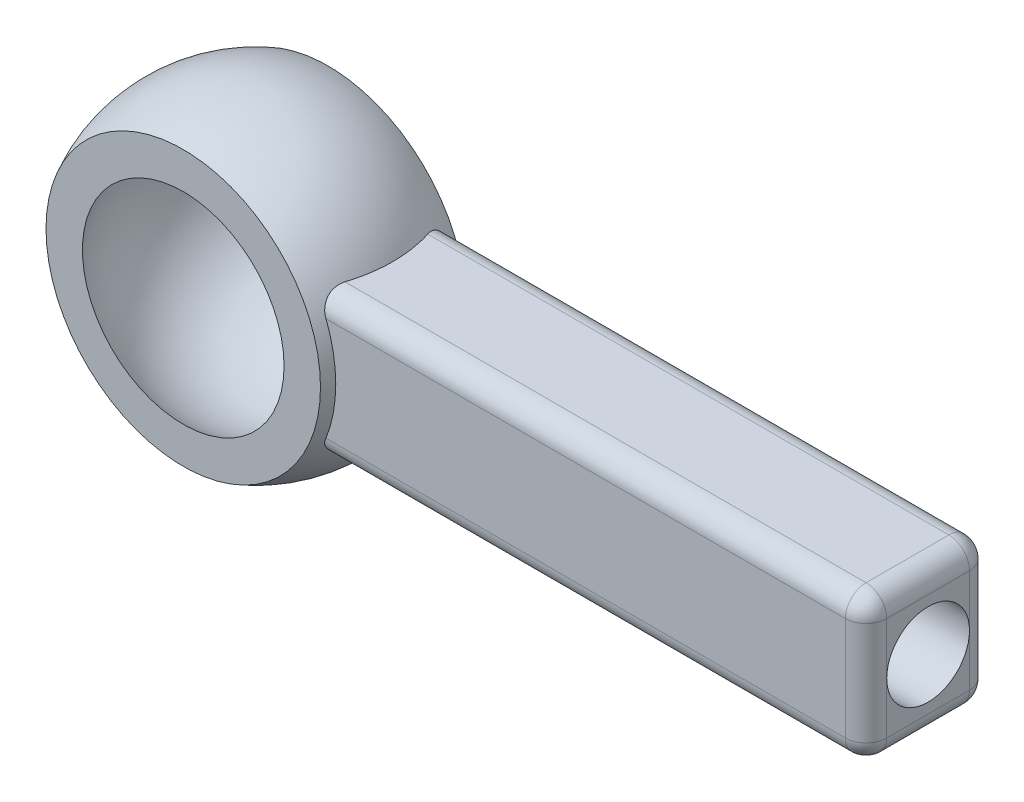
ISO-10303-21;
HEADER;
FILE_DESCRIPTION(('STEP AP214'),'2;1');
FILE_NAME('part.step','',(''),(''),'','','');
FILE_SCHEMA(('AUTOMOTIVE_DESIGN { 1 0 10303 214 1 1 1 1 }'));
ENDSEC;
DATA;
#1=APPLICATION_CONTEXT('core data for automotive mechanical design processes');
#2=APPLICATION_PROTOCOL_DEFINITION('international standard','automotive_design',2000,#1);
#3=PRODUCT_CONTEXT('',#1,'mechanical');
#4=PRODUCT('Part','Part','',(#3));
#5=PRODUCT_RELATED_PRODUCT_CATEGORY('part','',(#4));
#6=PRODUCT_DEFINITION_FORMATION('','',#4);
#7=PRODUCT_DEFINITION_CONTEXT('part definition',#1,'design');
#8=PRODUCT_DEFINITION('design','',#6,#7);
#9=PRODUCT_DEFINITION_SHAPE('','',#8);
#10=(LENGTH_UNIT() NAMED_UNIT(*) SI_UNIT(.MILLI.,.METRE.));
#11=(NAMED_UNIT(*) PLANE_ANGLE_UNIT() SI_UNIT($,.RADIAN.));
#12=(NAMED_UNIT(*) SI_UNIT($,.STERADIAN.) SOLID_ANGLE_UNIT());
#13=UNCERTAINTY_MEASURE_WITH_UNIT(LENGTH_MEASURE(1.E-05),#10,'distance_accuracy_value','');
#14=(GEOMETRIC_REPRESENTATION_CONTEXT(3) GLOBAL_UNCERTAINTY_ASSIGNED_CONTEXT((#13)) GLOBAL_UNIT_ASSIGNED_CONTEXT((#10,
#11,#12)) REPRESENTATION_CONTEXT('',''));
#15=CARTESIAN_POINT('',(0.,0.,0.));
#16=DIRECTION('',(0.,0.,1.));
#17=DIRECTION('',(1.,0.,0.));
#18=AXIS2_PLACEMENT_3D('',#15,#16,#17);
#19=CARTESIAN_POINT('',(16.25,0.,1.5));
#20=DIRECTION('',(-1.,0.,0.));
#21=DIRECTION('',(0.,0.,1.));
#22=AXIS2_PLACEMENT_3D('',#19,#20,#21);
#23=PLANE('',#22);
#24=DIRECTION('',(0.,1.,0.));
#25=VECTOR('',#24,1.);
#26=CARTESIAN_POINT('',(16.25,-1.75,1.));
#27=LINE('',#26,#25);
#28=CARTESIAN_POINT('',(16.25,1.25,1.));
#29=VERTEX_POINT('',#28);
#30=CARTESIAN_POINT('',(16.25,0.,1.));
#31=VERTEX_POINT('',#30);
#32=EDGE_CURVE('E146',#29,#31,#27,.F.);
#33=ORIENTED_EDGE('',*,*,#32,.T.);
#34=CARTESIAN_POINT('',(16.25,0.,0.));
#35=DIRECTION('',(1.,0.,0.));
#36=DIRECTION('',(0.,0.,-1.));
#37=AXIS2_PLACEMENT_3D('',#34,#35,#36);
#38=CIRCLE('',#37,1.);
#39=CARTESIAN_POINT('',(16.25,0.,-1.));
#40=VERTEX_POINT('',#39);
#41=EDGE_CURVE('E68',#40,#31,#38,.T.);
#42=ORIENTED_EDGE('',*,*,#41,.F.);
#43=DIRECTION('',(0.,1.,0.));
#44=VECTOR('',#43,1.);
#45=CARTESIAN_POINT('',(16.25,0.,-1.));
#46=LINE('',#45,#44);
#47=CARTESIAN_POINT('',(16.25,1.25,-1.));
#48=VERTEX_POINT('',#47);
#49=EDGE_CURVE('E143',#40,#48,#46,.T.);
#50=ORIENTED_EDGE('',*,*,#49,.T.);
#51=DIRECTION('',(0.,0.,-1.));
#52=VECTOR('',#51,1.);
#53=CARTESIAN_POINT('',(16.25,1.25,1.5));
#54=LINE('',#53,#52);
#55=EDGE_CURVE('E158',#48,#29,#54,.F.);
#56=ORIENTED_EDGE('',*,*,#55,.T.);
#57=EDGE_LOOP('',(#33,#42,#50,#56));
#58=FACE_BOUND('',#57,.T.);
#59=ADVANCED_FACE('F51',(#58),#23,.F.);
#60=CARTESIAN_POINT('',(0.,0.,1.5));
#61=DIRECTION('',(0.,0.,-1.));
#62=DIRECTION('',(-1.,0.,0.));
#63=AXIS2_PLACEMENT_3D('',#60,#61,#62);
#64=CYLINDRICAL_SURFACE('',#63,3.31662479035541);
#65=CARTESIAN_POINT('',(0.,0.,1.5));
#66=DIRECTION('',(0.,0.,1.));
#67=DIRECTION('',(1.,0.,0.));
#68=AXIS2_PLACEMENT_3D('',#65,#66,#67);
#69=CIRCLE('',#68,3.31662479035541);
#70=CARTESIAN_POINT('',(3.07205143186114,-1.25,1.5));
#71=VERTEX_POINT('',#70);
#72=CARTESIAN_POINT('',(3.07205143186114,1.25,1.5));
#73=VERTEX_POINT('',#72);
#74=EDGE_CURVE('E271',#71,#73,#69,.T.);
#75=ORIENTED_EDGE('',*,*,#74,.T.);
#76=CARTESIAN_POINT('',(3.07205143186114,1.25,1.5));
#77=CARTESIAN_POINT('',(3.05951716716795,1.28085326421244,1.50000625752836));
#78=CARTESIAN_POINT('',(3.04649612903649,1.31147635798939,1.49714616368271));
#79=CARTESIAN_POINT('',(3.01995026656549,1.37147503080527,1.48597579779519));
#80=CARTESIAN_POINT('',(3.00642564028248,1.40085109076338,1.4776676475079));
#81=CARTESIAN_POINT('',(2.97933777323533,1.45758140787642,1.45588799791597));
#82=CARTESIAN_POINT('',(2.96577455182225,1.48493653874114,1.44241874568149));
#83=CARTESIAN_POINT('',(2.93915744989482,1.53694665784621,1.41059821188456));
#84=CARTESIAN_POINT('',(2.92610373931253,1.56160075010678,1.39224531721668));
#85=CARTESIAN_POINT('',(2.90116582111065,1.60745738605937,1.35096475435379));
#86=CARTESIAN_POINT('',(2.88928173300445,1.62865957717662,1.3280366193786));
#87=CARTESIAN_POINT('',(2.86747002849805,1.66676287817648,1.27801875789377));
#88=CARTESIAN_POINT('',(2.85754135775579,1.68366630734994,1.25093128815695));
#89=CARTESIAN_POINT('',(2.84137852508916,1.71078720846847,1.19624135149293));
#90=CARTESIAN_POINT('',(2.8348714509887,1.72150956335215,1.16897096168966));
#91=CARTESIAN_POINT('',(2.82475723383143,1.73805733610636,1.11250976824045));
#92=CARTESIAN_POINT('',(2.82114096478742,1.74389816714553,1.0833253253148));
#93=CARTESIAN_POINT('',(2.81855852343455,1.74806414034862,1.04487487130751));
#94=CARTESIAN_POINT('',(2.81810828881504,1.7487898063252,1.03591641459409));
#95=CARTESIAN_POINT('',(2.81750789502449,1.74975706825781,1.01797366235106));
#96=CARTESIAN_POINT('',(2.81735739327644,1.74999921684657,1.00898940808672));
#97=CARTESIAN_POINT('',(2.8173569173963,1.75000000000001,0.999999999999993));
#98=B_SPLINE_CURVE_WITH_KNOTS('',3,(#76,#77,#78,#79,#80,#81,#82,#83,#84,#85,#86,#87,#88,#89,#90,
#91,#92,#93,#94,#95,#96,#97),.UNSPECIFIED.,.F.,.F.,(4,2,2,2,2,2,2,2,2,2,4),(0.,
0.0997393543340184,0.199439888062732,0.299097062834005,0.398787196101603,0.498487505270334,
0.598133908933175,0.687653897745174,0.776890152198911,0.803874479015644,0.830827946596107),.UNSPECIFIED.);
#99=CARTESIAN_POINT('',(2.81735691739617,1.75,1.));
#100=VERTEX_POINT('',#99);
#101=EDGE_CURVE('E12',#73,#100,#98,.T.);
#102=ORIENTED_EDGE('',*,*,#101,.T.);
#103=DIRECTION('',(0.,0.,-1.));
#104=VECTOR('',#103,1.);
#105=CARTESIAN_POINT('',(2.81735691739617,1.75,1.5));
#106=LINE('',#105,#104);
#107=CARTESIAN_POINT('',(2.81735691739617,1.75,-1.));
#108=VERTEX_POINT('',#107);
#109=EDGE_CURVE('E277',#100,#108,#106,.T.);
#110=ORIENTED_EDGE('',*,*,#109,.T.);
#111=CARTESIAN_POINT('',(2.81735691739617,1.75,-1.));
#112=CARTESIAN_POINT('',(2.81732616235446,1.75003347822931,-1.02538874100999));
#113=CARTESIAN_POINT('',(2.81855660015258,1.74806879890989,-1.05073828399465));
#114=CARTESIAN_POINT('',(2.8232876384964,1.74042563739447,-1.10051933722266));
#115=CARTESIAN_POINT('',(2.82677602695598,1.73476713179766,-1.12495504229114));
#116=CARTESIAN_POINT('',(2.83576910778328,1.72002412264029,-1.1723220212359));
#117=CARTESIAN_POINT('',(2.84127088499834,1.71094457179537,-1.19525541396637));
#118=CARTESIAN_POINT('',(2.85392707665943,1.68974950439975,-1.23919847535034));
#119=CARTESIAN_POINT('',(2.86108345397428,1.67763038051358,-1.26020581744351));
#120=CARTESIAN_POINT('',(2.87720529066611,1.64983761848636,-1.30130953559642));
#121=CARTESIAN_POINT('',(2.8862615670849,1.63397627619079,-1.32124275169242));
#122=CARTESIAN_POINT('',(2.90538737105043,1.59972169660947,-1.35823299124591));
#123=CARTESIAN_POINT('',(2.91545729571987,1.58132746595318,-1.37528888037931));
#124=CARTESIAN_POINT('',(2.93767305956027,1.53970987125141,-1.40849973603254));
#125=CARTESIAN_POINT('',(2.94991255243022,1.51617078834827,-1.42419731941702));
#126=CARTESIAN_POINT('',(2.97470938530458,1.46692406365028,-1.45137070463853));
#127=CARTESIAN_POINT('',(2.9872668067529,1.44121586217556,-1.46284541276156));
#128=CARTESIAN_POINT('',(3.01215783251826,1.38843150000569,-1.4812587650226));
#129=CARTESIAN_POINT('',(3.024492433719,1.36136990563845,-1.48823771119862));
#130=CARTESIAN_POINT('',(3.04870332449196,1.30626824134094,-1.49761088544545));
#131=CARTESIAN_POINT('',(3.06057960674665,1.27822815580167,-1.50000504034514));
#132=CARTESIAN_POINT('',(3.07205143186114,1.25,-1.5));
#133=B_SPLINE_CURVE_WITH_KNOTS('',3,(#111,#112,#113,#114,#115,#116,#117,#118,#119,#120,#121,
#122,#123,#124,#125,#126,#127,#128,#129,#130,#131,#132),.UNSPECIFIED.,.F.,.F.,(4,2,2,2,2,2,2,2,
2,2,4),(0.,0.0759987799774895,0.151589918130034,0.227072039357674,0.302644169459036,
0.383436473880531,0.464260554869811,0.556356632420274,0.648476545862756,0.739758719958931,
0.831042350863409),.UNSPECIFIED.);
#134=CARTESIAN_POINT('',(3.07205143186114,1.25,-1.5));
#135=VERTEX_POINT('',#134);
#136=EDGE_CURVE('E186',#108,#135,#133,.T.);
#137=ORIENTED_EDGE('',*,*,#136,.T.);
#138=CARTESIAN_POINT('',(0.,0.,-1.5));
#139=DIRECTION('',(0.,0.,1.));
#140=DIRECTION('',(1.,0.,0.));
#141=AXIS2_PLACEMENT_3D('',#138,#139,#140);
#142=CIRCLE('',#141,3.31662479035541);
#143=CARTESIAN_POINT('',(3.07205143186114,-1.25,-1.5));
#144=VERTEX_POINT('',#143);
#145=EDGE_CURVE('E269',#144,#135,#142,.T.);
#146=ORIENTED_EDGE('',*,*,#145,.F.);
#147=CARTESIAN_POINT('',(3.07205143186114,-1.25,-1.5));
#148=CARTESIAN_POINT('',(3.05951716716795,-1.28085326421244,-1.50000625752836));
#149=CARTESIAN_POINT('',(3.04649612903649,-1.31147635798939,-1.49714616368271));
#150=CARTESIAN_POINT('',(3.01995026656549,-1.37147503080527,-1.48597579779519));
#151=CARTESIAN_POINT('',(3.00642564028248,-1.40085109076338,-1.4776676475079));
#152=CARTESIAN_POINT('',(2.97933777323533,-1.45758140787642,-1.45588799791597));
#153=CARTESIAN_POINT('',(2.96577455182225,-1.48493653874114,-1.44241874568149));
#154=CARTESIAN_POINT('',(2.93915744989482,-1.53694665784621,-1.41059821188456));
#155=CARTESIAN_POINT('',(2.92610373931253,-1.56160075010678,-1.39224531721668));
#156=CARTESIAN_POINT('',(2.90116582111065,-1.60745738605937,-1.35096475435379));
#157=CARTESIAN_POINT('',(2.88928173300445,-1.62865957717662,-1.3280366193786));
#158=CARTESIAN_POINT('',(2.86747002849805,-1.66676287817648,-1.27801875789377));
#159=CARTESIAN_POINT('',(2.85754135775579,-1.68366630734994,-1.25093128815695));
#160=CARTESIAN_POINT('',(2.84137852508916,-1.71078720846847,-1.19624135149294));
#161=CARTESIAN_POINT('',(2.8348714509887,-1.72150956335215,-1.16897096168966));
#162=CARTESIAN_POINT('',(2.82475723383143,-1.73805733610636,-1.11250976824045));
#163=CARTESIAN_POINT('',(2.82114096478742,-1.74389816714553,-1.0833253253148));
#164=CARTESIAN_POINT('',(2.81855852343455,-1.74806414034862,-1.04487487130751));
#165=CARTESIAN_POINT('',(2.81810828881504,-1.7487898063252,-1.03591641459409));
#166=CARTESIAN_POINT('',(2.81750789502449,-1.74975706825781,-1.01797366235106));
#167=CARTESIAN_POINT('',(2.81735739327644,-1.74999921684657,-1.00898940808672));
#168=CARTESIAN_POINT('',(2.8173569173963,-1.75000000000001,-0.999999999999993));
#169=B_SPLINE_CURVE_WITH_KNOTS('',3,(#147,#148,#149,#150,#151,#152,#153,#154,#155,#156,#157,
#158,#159,#160,#161,#162,#163,#164,#165,#166,#167,#168),.UNSPECIFIED.,.F.,.F.,(4,2,2,2,2,2,2,2,
2,2,4),(0.,0.0997393543340184,0.199439888062732,0.299097062834005,0.398787196101603,
0.498487505270333,0.598133908933174,0.687653897745173,0.776890152198911,0.803874479015644,
0.830827946596107),.UNSPECIFIED.);
#170=CARTESIAN_POINT('',(2.81735691739617,-1.75,-1.));
#171=VERTEX_POINT('',#170);
#172=EDGE_CURVE('E193',#144,#171,#169,.T.);
#173=ORIENTED_EDGE('',*,*,#172,.T.);
#174=DIRECTION('',(0.,0.,-1.));
#175=VECTOR('',#174,1.);
#176=CARTESIAN_POINT('',(2.81735691739617,-1.75,1.5));
#177=LINE('',#176,#175);
#178=CARTESIAN_POINT('',(2.81735691739617,-1.75,1.));
#179=VERTEX_POINT('',#178);
#180=EDGE_CURVE('E282',#179,#171,#177,.T.);
#181=ORIENTED_EDGE('',*,*,#180,.F.);
#182=CARTESIAN_POINT('',(2.81735691739617,-1.75,1.));
#183=CARTESIAN_POINT('',(2.81732616235446,-1.75003347822931,1.02538874100999));
#184=CARTESIAN_POINT('',(2.81855660015258,-1.74806879890989,1.05073828399465));
#185=CARTESIAN_POINT('',(2.8232876384964,-1.74042563739447,1.10051933722266));
#186=CARTESIAN_POINT('',(2.82677602695598,-1.73476713179766,1.12495504229114));
#187=CARTESIAN_POINT('',(2.83576910778328,-1.72002412264029,1.1723220212359));
#188=CARTESIAN_POINT('',(2.84127088499834,-1.71094457179537,1.19525541396637));
#189=CARTESIAN_POINT('',(2.85392707665943,-1.68974950439975,1.23919847535034));
#190=CARTESIAN_POINT('',(2.86108345397428,-1.67763038051358,1.26020581744351));
#191=CARTESIAN_POINT('',(2.87720529066611,-1.64983761848636,1.30130953559642));
#192=CARTESIAN_POINT('',(2.8862615670849,-1.63397627619079,1.32124275169242));
#193=CARTESIAN_POINT('',(2.90538737105043,-1.59972169660947,1.35823299124591));
#194=CARTESIAN_POINT('',(2.91545729571987,-1.58132746595319,1.37528888037931));
#195=CARTESIAN_POINT('',(2.93767305956027,-1.53970987125141,1.40849973603254));
#196=CARTESIAN_POINT('',(2.94991255243022,-1.51617078834827,1.42419731941702));
#197=CARTESIAN_POINT('',(2.97470938530458,-1.46692406365028,1.45137070463853));
#198=CARTESIAN_POINT('',(2.9872668067529,-1.44121586217556,1.46284541276156));
#199=CARTESIAN_POINT('',(3.01215783251826,-1.38843150000569,1.4812587650226));
#200=CARTESIAN_POINT('',(3.024492433719,-1.36136990563846,1.48823771119862));
#201=CARTESIAN_POINT('',(3.04870332449196,-1.30626824134094,1.49761088544544));
#202=CARTESIAN_POINT('',(3.06057960674665,-1.27822815580167,1.50000504034514));
#203=CARTESIAN_POINT('',(3.07205143186114,-1.25,1.5));
#204=B_SPLINE_CURVE_WITH_KNOTS('',3,(#182,#183,#184,#185,#186,#187,#188,#189,#190,#191,#192,
#193,#194,#195,#196,#197,#198,#199,#200,#201,#202,#203),.UNSPECIFIED.,.F.,.F.,(4,2,2,2,2,2,2,2,
2,2,4),(0.,0.0759987799774895,0.151589918130034,0.227072039357674,0.302644169459036,
0.38343647388053,0.464260554869811,0.556356632420274,0.648476545862756,0.73975871995893,
0.831042350863409),.UNSPECIFIED.);
#205=EDGE_CURVE('E61',#179,#71,#204,.T.);
#206=ORIENTED_EDGE('',*,*,#205,.T.);
#207=EDGE_LOOP('',(#75,#102,#110,#137,#146,#173,#181,#206));
#208=FACE_BOUND('',#207,.T.);
#209=ADVANCED_FACE('F199',(#208),#64,.F.);
#210=CARTESIAN_POINT('',(0.,-1.75,1.5));
#211=DIRECTION('',(0.,-1.,0.));
#212=DIRECTION('',(0.,0.,-1.));
#213=AXIS2_PLACEMENT_3D('',#210,#211,#212);
#214=PLANE('',#213);
#215=DIRECTION('',(0.,0.,-1.));
#216=VECTOR('',#215,1.);
#217=CARTESIAN_POINT('',(15.75,-1.75,1.5));
#218=LINE('',#217,#216);
#219=CARTESIAN_POINT('',(15.75,-1.75,-1.));
#220=VERTEX_POINT('',#219);
#221=CARTESIAN_POINT('',(15.75,-1.75,1.));
#222=VERTEX_POINT('',#221);
#223=EDGE_CURVE('E171',#220,#222,#218,.F.);
#224=ORIENTED_EDGE('',*,*,#223,.T.);
#225=DIRECTION('',(-1.,0.,0.));
#226=VECTOR('',#225,1.);
#227=CARTESIAN_POINT('',(0.,-1.75,1.));
#228=LINE('',#227,#226);
#229=EDGE_CURVE('E173',#222,#179,#228,.T.);
#230=ORIENTED_EDGE('',*,*,#229,.T.);
#231=ORIENTED_EDGE('',*,*,#180,.T.);
#232=DIRECTION('',(-1.,0.,0.));
#233=VECTOR('',#232,1.);
#234=CARTESIAN_POINT('',(16.25,-1.75,-1.));
#235=LINE('',#234,#233);
#236=EDGE_CURVE('E169',#171,#220,#235,.F.);
#237=ORIENTED_EDGE('',*,*,#236,.T.);
#238=EDGE_LOOP('',(#224,#230,#231,#237));
#239=FACE_BOUND('',#238,.T.);
#240=ADVANCED_FACE('F316',(#239),#214,.T.);
#241=CARTESIAN_POINT('',(16.25,-1.25,-1.));
#242=VERTEX_POINT('',#241);
#243=EDGE_CURVE('E152',#242,#40,#46,.T.);
#244=ORIENTED_EDGE('',*,*,#243,.T.);
#245=EDGE_CURVE('E134',#31,#40,#38,.T.);
#246=ORIENTED_EDGE('',*,*,#245,.F.);
#247=CARTESIAN_POINT('',(16.25,-1.25,1.));
#248=VERTEX_POINT('',#247);
#249=EDGE_CURVE('E163',#31,#248,#27,.F.);
#250=ORIENTED_EDGE('',*,*,#249,.T.);
#251=DIRECTION('',(0.,0.,-1.));
#252=VECTOR('',#251,1.);
#253=CARTESIAN_POINT('',(16.25,-1.25,-1.5));
#254=LINE('',#253,#252);
#255=EDGE_CURVE('E162',#248,#242,#254,.T.);
#256=ORIENTED_EDGE('',*,*,#255,.T.);
#257=EDGE_LOOP('',(#244,#246,#250,#256));
#258=FACE_BOUND('',#257,.T.);
#259=ADVANCED_FACE('F160',(#258),#23,.F.);
#260=CARTESIAN_POINT('',(0.,1.75,1.5));
#261=DIRECTION('',(0.,-1.,0.));
#262=DIRECTION('',(1.,0.,0.));
#263=AXIS2_PLACEMENT_3D('',#260,#261,#262);
#264=PLANE('',#263);
#265=ORIENTED_EDGE('',*,*,#109,.F.);
#266=DIRECTION('',(-1.,0.,0.));
#267=VECTOR('',#266,1.);
#268=CARTESIAN_POINT('',(16.25,1.75,1.));
#269=LINE('',#268,#267);
#270=CARTESIAN_POINT('',(15.75,1.75,1.));
#271=VERTEX_POINT('',#270);
#272=EDGE_CURVE('E76',#100,#271,#269,.F.);
#273=ORIENTED_EDGE('',*,*,#272,.T.);
#274=DIRECTION('',(0.,0.,-1.));
#275=VECTOR('',#274,1.);
#276=CARTESIAN_POINT('',(15.75,1.75,1.5));
#277=LINE('',#276,#275);
#278=CARTESIAN_POINT('',(15.75,1.75,-1.));
#279=VERTEX_POINT('',#278);
#280=EDGE_CURVE('E183',#271,#279,#277,.T.);
#281=ORIENTED_EDGE('',*,*,#280,.T.);
#282=DIRECTION('',(-1.,0.,0.));
#283=VECTOR('',#282,1.);
#284=CARTESIAN_POINT('',(0.,1.75,-1.));
#285=LINE('',#284,#283);
#286=EDGE_CURVE('E181',#279,#108,#285,.T.);
#287=ORIENTED_EDGE('',*,*,#286,.T.);
#288=EDGE_LOOP('',(#265,#273,#281,#287));
#289=FACE_BOUND('',#288,.T.);
#290=ADVANCED_FACE('F327',(#289),#264,.F.);
#291=CARTESIAN_POINT('',(0.,0.,1.5));
#292=DIRECTION('',(0.,0.,1.));
#293=DIRECTION('',(1.,0.,0.));
#294=AXIS2_PLACEMENT_3D('',#291,#292,#293);
#295=PLANE('',#294);
#296=DIRECTION('',(0.,1.,0.));
#297=VECTOR('',#296,1.);
#298=CARTESIAN_POINT('',(15.75,1.75,1.5));
#299=LINE('',#298,#297);
#300=CARTESIAN_POINT('',(15.75,-1.25,1.5));
#301=VERTEX_POINT('',#300);
#302=CARTESIAN_POINT('',(15.75,1.25,1.5));
#303=VERTEX_POINT('',#302);
#304=EDGE_CURVE('E287',#301,#303,#299,.T.);
#305=ORIENTED_EDGE('',*,*,#304,.T.);
#306=DIRECTION('',(-1.,0.,0.));
#307=VECTOR('',#306,1.);
#308=CARTESIAN_POINT('',(2.81735691739617,1.25,1.5));
#309=LINE('',#308,#307);
#310=EDGE_CURVE('E289',#303,#73,#309,.T.);
#311=ORIENTED_EDGE('',*,*,#310,.T.);
#312=ORIENTED_EDGE('',*,*,#74,.F.);
#313=DIRECTION('',(-1.,0.,0.));
#314=VECTOR('',#313,1.);
#315=CARTESIAN_POINT('',(0.,-1.25,1.5));
#316=LINE('',#315,#314);
#317=EDGE_CURVE('E285',#71,#301,#316,.F.);
#318=ORIENTED_EDGE('',*,*,#317,.T.);
#319=EDGE_LOOP('',(#305,#311,#312,#318));
#320=FACE_BOUND('',#319,.T.);
#321=ADVANCED_FACE('F306',(#320),#295,.T.);
#322=CARTESIAN_POINT('',(0.,0.,-1.5));
#323=DIRECTION('',(0.,0.,1.));
#324=DIRECTION('',(1.,0.,0.));
#325=AXIS2_PLACEMENT_3D('',#322,#323,#324);
#326=PLANE('',#325);
#327=DIRECTION('',(0.,1.,0.));
#328=VECTOR('',#327,1.);
#329=CARTESIAN_POINT('',(15.75,0.,-1.5));
#330=LINE('',#329,#328);
#331=CARTESIAN_POINT('',(15.75,1.25,-1.5));
#332=VERTEX_POINT('',#331);
#333=CARTESIAN_POINT('',(15.75,-1.25,-1.5));
#334=VERTEX_POINT('',#333);
#335=EDGE_CURVE('E177',#332,#334,#330,.F.);
#336=ORIENTED_EDGE('',*,*,#335,.T.);
#337=DIRECTION('',(-1.,0.,0.));
#338=VECTOR('',#337,1.);
#339=CARTESIAN_POINT('',(2.81735691739617,-1.25,-1.5));
#340=LINE('',#339,#338);
#341=EDGE_CURVE('E179',#334,#144,#340,.T.);
#342=ORIENTED_EDGE('',*,*,#341,.T.);
#343=ORIENTED_EDGE('',*,*,#145,.T.);
#344=DIRECTION('',(-1.,0.,0.));
#345=VECTOR('',#344,1.);
#346=CARTESIAN_POINT('',(0.,1.25,-1.5));
#347=LINE('',#346,#345);
#348=EDGE_CURVE('E175',#135,#332,#347,.F.);
#349=ORIENTED_EDGE('',*,*,#348,.T.);
#350=EDGE_LOOP('',(#336,#342,#343,#349));
#351=FACE_BOUND('',#350,.T.);
#352=ADVANCED_FACE('F334',(#351),#326,.F.);
#353=CARTESIAN_POINT('',(0.,-1.25,-1.));
#354=DIRECTION('',(1.,0.,0.));
#355=DIRECTION('',(0.,0.,-1.));
#356=AXIS2_PLACEMENT_3D('',#353,#354,#355);
#357=CYLINDRICAL_SURFACE('',#356,0.5);
#358=ORIENTED_EDGE('',*,*,#172,.F.);
#359=ORIENTED_EDGE('',*,*,#341,.F.);
#360=CARTESIAN_POINT('',(15.75,-1.25,-1.));
#361=DIRECTION('',(1.,0.,0.));
#362=DIRECTION('',(0.,0.,-1.));
#363=AXIS2_PLACEMENT_3D('',#360,#361,#362);
#364=CIRCLE('',#363,0.5);
#365=EDGE_CURVE('E265',#220,#334,#364,.T.);
#366=ORIENTED_EDGE('',*,*,#365,.F.);
#367=ORIENTED_EDGE('',*,*,#236,.F.);
#368=EDGE_LOOP('',(#358,#359,#366,#367));
#369=FACE_BOUND('',#368,.T.);
#370=ADVANCED_FACE('F53',(#369),#357,.T.);
#371=CARTESIAN_POINT('',(0.,1.25,-1.));
#372=DIRECTION('',(-1.,0.,0.));
#373=DIRECTION('',(0.,-1.,0.));
#374=AXIS2_PLACEMENT_3D('',#371,#372,#373);
#375=CYLINDRICAL_SURFACE('',#374,0.5);
#376=ORIENTED_EDGE('',*,*,#136,.F.);
#377=ORIENTED_EDGE('',*,*,#286,.F.);
#378=CARTESIAN_POINT('',(15.75,1.25,-1.));
#379=DIRECTION('',(1.,0.,0.));
#380=DIRECTION('',(0.,0.,-1.));
#381=AXIS2_PLACEMENT_3D('',#378,#379,#380);
#382=CIRCLE('',#381,0.5);
#383=EDGE_CURVE('E263',#332,#279,#382,.T.);
#384=ORIENTED_EDGE('',*,*,#383,.F.);
#385=ORIENTED_EDGE('',*,*,#348,.F.);
#386=EDGE_LOOP('',(#376,#377,#384,#385));
#387=FACE_BOUND('',#386,.T.);
#388=ADVANCED_FACE('F203',(#387),#375,.T.);
#389=CARTESIAN_POINT('',(15.75,0.,-1.));
#390=DIRECTION('',(0.,1.,0.));
#391=DIRECTION('',(0.,0.,1.));
#392=AXIS2_PLACEMENT_3D('',#389,#390,#391);
#393=CYLINDRICAL_SURFACE('',#392,0.5);
#394=CARTESIAN_POINT('',(15.75,-1.25,-1.));
#395=DIRECTION('',(0.,-1.,0.));
#396=DIRECTION('',(0.,0.,-1.));
#397=AXIS2_PLACEMENT_3D('',#394,#395,#396);
#398=CIRCLE('',#397,0.5);
#399=EDGE_CURVE('E56',#334,#242,#398,.T.);
#400=ORIENTED_EDGE('',*,*,#399,.F.);
#401=ORIENTED_EDGE('',*,*,#335,.F.);
#402=CARTESIAN_POINT('',(15.75,1.25,-1.));
#403=DIRECTION('',(0.,1.,0.));
#404=DIRECTION('',(0.,0.,1.));
#405=AXIS2_PLACEMENT_3D('',#402,#403,#404);
#406=CIRCLE('',#405,0.5);
#407=EDGE_CURVE('E156',#48,#332,#406,.T.);
#408=ORIENTED_EDGE('',*,*,#407,.F.);
#409=ORIENTED_EDGE('',*,*,#49,.F.);
#410=ORIENTED_EDGE('',*,*,#243,.F.);
#411=EDGE_LOOP('',(#400,#401,#408,#409,#410));
#412=FACE_BOUND('',#411,.T.);
#413=ADVANCED_FACE('F151',(#412),#393,.T.);
#414=CARTESIAN_POINT('',(15.75,-1.25,-1.));
#415=DIRECTION('',(0.,0.,-1.));
#416=DIRECTION('',(-1.,0.,0.));
#417=AXIS2_PLACEMENT_3D('',#414,#415,#416);
#418=SPHERICAL_SURFACE('',#417,0.5);
#419=ORIENTED_EDGE('',*,*,#365,.T.);
#420=ORIENTED_EDGE('',*,*,#399,.T.);
#421=CARTESIAN_POINT('',(15.75,-1.25,-1.));
#422=DIRECTION('',(0.,0.,-1.));
#423=DIRECTION('',(-1.,0.,0.));
#424=AXIS2_PLACEMENT_3D('',#421,#422,#423);
#425=CIRCLE('',#424,0.5);
#426=EDGE_CURVE('E259',#220,#242,#425,.F.);
#427=ORIENTED_EDGE('',*,*,#426,.F.);
#428=EDGE_LOOP('',(#419,#420,#427));
#429=FACE_BOUND('',#428,.T.);
#430=ADVANCED_FACE('F210',(#429),#418,.T.);
#431=CARTESIAN_POINT('',(15.75,1.25,-1.));
#432=DIRECTION('',(0.,0.,-1.));
#433=DIRECTION('',(0.,1.,0.));
#434=AXIS2_PLACEMENT_3D('',#431,#432,#433);
#435=SPHERICAL_SURFACE('',#434,0.5);
#436=ORIENTED_EDGE('',*,*,#407,.T.);
#437=ORIENTED_EDGE('',*,*,#383,.T.);
#438=CARTESIAN_POINT('',(15.75,1.25,-1.));
#439=DIRECTION('',(0.,0.,-1.));
#440=DIRECTION('',(-1.,0.,0.));
#441=AXIS2_PLACEMENT_3D('',#438,#439,#440);
#442=CIRCLE('',#441,0.5);
#443=EDGE_CURVE('E256',#48,#279,#442,.F.);
#444=ORIENTED_EDGE('',*,*,#443,.F.);
#445=EDGE_LOOP('',(#436,#437,#444));
#446=FACE_BOUND('',#445,.T.);
#447=ADVANCED_FACE('F213',(#446),#435,.T.);
#448=CARTESIAN_POINT('',(15.75,-1.25,1.5));
#449=DIRECTION('',(0.,0.,1.));
#450=DIRECTION('',(1.,0.,0.));
#451=AXIS2_PLACEMENT_3D('',#448,#449,#450);
#452=CYLINDRICAL_SURFACE('',#451,0.5);
#453=ORIENTED_EDGE('',*,*,#426,.T.);
#454=ORIENTED_EDGE('',*,*,#255,.F.);
#455=CARTESIAN_POINT('',(15.75,-1.25,1.));
#456=DIRECTION('',(0.,0.,1.));
#457=DIRECTION('',(1.,0.,0.));
#458=AXIS2_PLACEMENT_3D('',#455,#456,#457);
#459=CIRCLE('',#458,0.5);
#460=EDGE_CURVE('E253',#222,#248,#459,.T.);
#461=ORIENTED_EDGE('',*,*,#460,.F.);
#462=ORIENTED_EDGE('',*,*,#223,.F.);
#463=EDGE_LOOP('',(#453,#454,#461,#462));
#464=FACE_BOUND('',#463,.T.);
#465=ADVANCED_FACE('F217',(#464),#452,.T.);
#466=CARTESIAN_POINT('',(0.,-1.25,1.));
#467=DIRECTION('',(-1.,0.,0.));
#468=DIRECTION('',(0.,0.,1.));
#469=AXIS2_PLACEMENT_3D('',#466,#467,#468);
#470=CYLINDRICAL_SURFACE('',#469,0.5);
#471=ORIENTED_EDGE('',*,*,#205,.F.);
#472=ORIENTED_EDGE('',*,*,#229,.F.);
#473=CARTESIAN_POINT('',(15.75,-1.25,1.));
#474=DIRECTION('',(1.,0.,0.));
#475=DIRECTION('',(0.,0.,-1.));
#476=AXIS2_PLACEMENT_3D('',#473,#474,#475);
#477=CIRCLE('',#476,0.5);
#478=EDGE_CURVE('E250',#301,#222,#477,.T.);
#479=ORIENTED_EDGE('',*,*,#478,.F.);
#480=ORIENTED_EDGE('',*,*,#317,.F.);
#481=EDGE_LOOP('',(#471,#472,#479,#480));
#482=FACE_BOUND('',#481,.T.);
#483=ADVANCED_FACE('F221',(#482),#470,.T.);
#484=CARTESIAN_POINT('',(0.,1.25,1.));
#485=DIRECTION('',(1.,0.,0.));
#486=DIRECTION('',(0.,1.,0.));
#487=AXIS2_PLACEMENT_3D('',#484,#485,#486);
#488=CYLINDRICAL_SURFACE('',#487,0.5);
#489=ORIENTED_EDGE('',*,*,#101,.F.);
#490=ORIENTED_EDGE('',*,*,#310,.F.);
#491=CARTESIAN_POINT('',(15.75,1.25,1.));
#492=DIRECTION('',(1.,0.,0.));
#493=DIRECTION('',(0.,0.,-1.));
#494=AXIS2_PLACEMENT_3D('',#491,#492,#493);
#495=CIRCLE('',#494,0.5);
#496=EDGE_CURVE('E247',#271,#303,#495,.T.);
#497=ORIENTED_EDGE('',*,*,#496,.F.);
#498=ORIENTED_EDGE('',*,*,#272,.F.);
#499=EDGE_LOOP('',(#489,#490,#497,#498));
#500=FACE_BOUND('',#499,.T.);
#501=ADVANCED_FACE('F226',(#500),#488,.T.);
#502=CARTESIAN_POINT('',(15.75,1.25,1.5));
#503=DIRECTION('',(0.,0.,-1.));
#504=DIRECTION('',(-1.,0.,0.));
#505=AXIS2_PLACEMENT_3D('',#502,#503,#504);
#506=CYLINDRICAL_SURFACE('',#505,0.5);
#507=ORIENTED_EDGE('',*,*,#443,.T.);
#508=ORIENTED_EDGE('',*,*,#280,.F.);
#509=CARTESIAN_POINT('',(15.75,1.25,1.));
#510=DIRECTION('',(0.,0.,1.));
#511=DIRECTION('',(1.,0.,0.));
#512=AXIS2_PLACEMENT_3D('',#509,#510,#511);
#513=CIRCLE('',#512,0.5);
#514=EDGE_CURVE('E244',#29,#271,#513,.T.);
#515=ORIENTED_EDGE('',*,*,#514,.F.);
#516=ORIENTED_EDGE('',*,*,#55,.F.);
#517=EDGE_LOOP('',(#507,#508,#515,#516));
#518=FACE_BOUND('',#517,.T.);
#519=ADVANCED_FACE('F296',(#518),#506,.T.);
#520=CARTESIAN_POINT('',(15.75,-1.25,1.));
#521=DIRECTION('',(0.,-1.,0.));
#522=DIRECTION('',(0.,0.,-1.));
#523=AXIS2_PLACEMENT_3D('',#520,#521,#522);
#524=SPHERICAL_SURFACE('',#523,0.5);
#525=ORIENTED_EDGE('',*,*,#478,.T.);
#526=ORIENTED_EDGE('',*,*,#460,.T.);
#527=CARTESIAN_POINT('',(15.75,-1.25,1.));
#528=DIRECTION('',(0.,-1.,0.));
#529=DIRECTION('',(0.,0.,-1.));
#530=AXIS2_PLACEMENT_3D('',#527,#528,#529);
#531=CIRCLE('',#530,0.5);
#532=EDGE_CURVE('E241',#301,#248,#531,.F.);
#533=ORIENTED_EDGE('',*,*,#532,.F.);
#534=EDGE_LOOP('',(#525,#526,#533));
#535=FACE_BOUND('',#534,.T.);
#536=ADVANCED_FACE('F312',(#535),#524,.T.);
#537=CARTESIAN_POINT('',(15.75,1.25,1.));
#538=DIRECTION('',(0.,1.,0.));
#539=DIRECTION('',(0.,0.,1.));
#540=AXIS2_PLACEMENT_3D('',#537,#538,#539);
#541=SPHERICAL_SURFACE('',#540,0.5);
#542=ORIENTED_EDGE('',*,*,#514,.T.);
#543=ORIENTED_EDGE('',*,*,#496,.T.);
#544=CARTESIAN_POINT('',(15.75,1.25,1.));
#545=DIRECTION('',(0.,1.,0.));
#546=DIRECTION('',(0.,0.,1.));
#547=AXIS2_PLACEMENT_3D('',#544,#545,#546);
#548=CIRCLE('',#547,0.5);
#549=EDGE_CURVE('E239',#29,#303,#548,.F.);
#550=ORIENTED_EDGE('',*,*,#549,.F.);
#551=EDGE_LOOP('',(#542,#543,#550));
#552=FACE_BOUND('',#551,.T.);
#553=ADVANCED_FACE('F303',(#552),#541,.T.);
#554=CARTESIAN_POINT('',(15.75,0.,1.));
#555=DIRECTION('',(0.,-1.,0.));
#556=DIRECTION('',(0.,0.,-1.));
#557=AXIS2_PLACEMENT_3D('',#554,#555,#556);
#558=CYLINDRICAL_SURFACE('',#557,0.5);
#559=ORIENTED_EDGE('',*,*,#532,.T.);
#560=ORIENTED_EDGE('',*,*,#249,.F.);
#561=ORIENTED_EDGE('',*,*,#32,.F.);
#562=ORIENTED_EDGE('',*,*,#549,.T.);
#563=ORIENTED_EDGE('',*,*,#304,.F.);
#564=EDGE_LOOP('',(#559,#560,#561,#562,#563));
#565=FACE_BOUND('',#564,.T.);
#566=ADVANCED_FACE('F301',(#565),#558,.T.);
#567=CARTESIAN_POINT('',(11.25,0.,0.));
#568=DIRECTION('',(1.,0.,0.));
#569=DIRECTION('',(0.,0.,-1.));
#570=AXIS2_PLACEMENT_3D('',#567,#568,#569);
#571=CYLINDRICAL_SURFACE('',#570,1.);
#572=CARTESIAN_POINT('',(11.25,0.,0.));
#573=DIRECTION('',(1.,0.,0.));
#574=DIRECTION('',(0.,0.,-1.));
#575=AXIS2_PLACEMENT_3D('',#572,#573,#574);
#576=CIRCLE('',#575,1.);
#577=CARTESIAN_POINT('',(11.25,0.,-1.));
#578=VERTEX_POINT('',#577);
#579=EDGE_CURVE('E147',#578,#578,#576,.T.);
#580=ORIENTED_EDGE('',*,*,#579,.F.);
#581=EDGE_LOOP('',(#580));
#582=FACE_BOUND('',#581,.T.);
#583=ORIENTED_EDGE('',*,*,#41,.T.);
#584=ORIENTED_EDGE('',*,*,#245,.T.);
#585=EDGE_LOOP('',(#583,#584));
#586=FACE_BOUND('',#585,.T.);
#587=ADVANCED_FACE('F135',(#582,#586),#571,.F.);
#588=CARTESIAN_POINT('',(11.25,0.,0.));
#589=DIRECTION('',(1.,0.,0.));
#590=DIRECTION('',(0.,0.,-1.));
#591=AXIS2_PLACEMENT_3D('',#588,#589,#590);
#592=PLANE('',#591);
#593=ORIENTED_EDGE('',*,*,#579,.T.);
#594=EDGE_LOOP('',(#593));
#595=FACE_BOUND('',#594,.T.);
#596=ADVANCED_FACE('F458',(#595),#592,.T.);
#597=CLOSED_SHELL('',(#59,#209,#240,#259,#290,#321,#352,#370,#388,#413,#430,#447,#465,#483,#501,
#519,#536,#553,#566,#587,#596));
#598=MANIFOLD_SOLID_BREP('B2',#597);
#599=CARTESIAN_POINT('',(0.,0.,0.));
#600=DIRECTION('',(0.,0.,1.));
#601=DIRECTION('',(-1.,0.,0.));
#602=AXIS2_PLACEMENT_3D('',#599,#600,#601);
#603=SPHERICAL_SURFACE('',#602,3.);
#604=CARTESIAN_POINT('',(0.,0.,-1.75000000000002));
#605=DIRECTION('',(0.,0.,1.));
#606=DIRECTION('',(1.,0.,0.));
#607=AXIS2_PLACEMENT_3D('',#604,#605,#606);
#608=CIRCLE('',#607,2.43669858620224);
#609=CARTESIAN_POINT('',(2.43669858620223,0.,-1.75000000000002));
#610=VERTEX_POINT('',#609);
#611=EDGE_CURVE('E50',#610,#610,#608,.T.);
#612=ORIENTED_EDGE('',*,*,#611,.F.);
#613=EDGE_LOOP('',(#612));
#614=FACE_BOUND('',#613,.T.);
#615=CARTESIAN_POINT('',(0.,0.,1.74999999999999));
#616=DIRECTION('',(0.,0.,1.));
#617=DIRECTION('',(1.,0.,0.));
#618=AXIS2_PLACEMENT_3D('',#615,#616,#617);
#619=CIRCLE('',#618,2.43669858620225);
#620=CARTESIAN_POINT('',(2.43669858620225,0.,1.74999999999998));
#621=VERTEX_POINT('',#620);
#622=EDGE_CURVE('E516',#621,#621,#619,.T.);
#623=ORIENTED_EDGE('',*,*,#622,.T.);
#624=EDGE_LOOP('',(#623));
#625=FACE_BOUND('',#624,.T.);
#626=ADVANCED_FACE('F502',(#614,#625),#603,.F.);
#627=CARTESIAN_POINT('',(-2.43669858620224,0.,-1.75));
#628=DIRECTION('',(0.,0.,1.));
#629=DIRECTION('',(1.,0.,0.));
#630=AXIS2_PLACEMENT_3D('',#627,#628,#629);
#631=PLANE('',#630);
#632=CARTESIAN_POINT('',(0.,0.,-1.75000000000002));
#633=DIRECTION('',(0.,0.,1.));
#634=DIRECTION('',(1.,0.,0.));
#635=AXIS2_PLACEMENT_3D('',#632,#633,#634);
#636=CIRCLE('',#635,3.31662479035539);
#637=CARTESIAN_POINT('',(3.31662479035539,0.,-1.75000000000003));
#638=VERTEX_POINT('',#637);
#639=EDGE_CURVE('E508',#638,#638,#636,.T.);
#640=ORIENTED_EDGE('',*,*,#639,.F.);
#641=EDGE_LOOP('',(#640));
#642=FACE_BOUND('',#641,.T.);
#643=ORIENTED_EDGE('',*,*,#611,.T.);
#644=EDGE_LOOP('',(#643));
#645=FACE_BOUND('',#644,.T.);
#646=ADVANCED_FACE('F531',(#642,#645),#631,.F.);
#647=CARTESIAN_POINT('',(0.,0.,0.));
#648=DIRECTION('',(0.,0.,1.));
#649=DIRECTION('',(-1.,0.,0.));
#650=AXIS2_PLACEMENT_3D('',#647,#648,#649);
#651=SPHERICAL_SURFACE('',#650,3.75);
#652=CARTESIAN_POINT('',(0.,0.,1.74999999999999));
#653=DIRECTION('',(0.,0.,1.));
#654=DIRECTION('',(1.,0.,0.));
#655=AXIS2_PLACEMENT_3D('',#652,#653,#654);
#656=CIRCLE('',#655,3.31662479035541);
#657=CARTESIAN_POINT('',(3.31662479035541,0.,1.74999999999998));
#658=VERTEX_POINT('',#657);
#659=EDGE_CURVE('E512',#658,#658,#656,.T.);
#660=ORIENTED_EDGE('',*,*,#659,.F.);
#661=EDGE_LOOP('',(#660));
#662=FACE_BOUND('',#661,.T.);
#663=ORIENTED_EDGE('',*,*,#639,.T.);
#664=EDGE_LOOP('',(#663));
#665=FACE_BOUND('',#664,.T.);
#666=ADVANCED_FACE('F526',(#662,#665),#651,.T.);
#667=CARTESIAN_POINT('',(-2.43669858620224,0.,1.75));
#668=DIRECTION('',(0.,0.,-1.));
#669=DIRECTION('',(-1.,0.,0.));
#670=AXIS2_PLACEMENT_3D('',#667,#668,#669);
#671=PLANE('',#670);
#672=ORIENTED_EDGE('',*,*,#622,.F.);
#673=EDGE_LOOP('',(#672));
#674=FACE_BOUND('',#673,.T.);
#675=ORIENTED_EDGE('',*,*,#659,.T.);
#676=EDGE_LOOP('',(#675));
#677=FACE_BOUND('',#676,.T.);
#678=ADVANCED_FACE('F523',(#674,#677),#671,.F.);
#679=CLOSED_SHELL('',(#626,#646,#666,#678));
#680=MANIFOLD_SOLID_BREP('B6',#679);
#681=ADVANCED_BREP_SHAPE_REPRESENTATION('',(#18,#598,#680),#14);
#682=SHAPE_DEFINITION_REPRESENTATION(#9,#681);
ENDSEC;
END-ISO-10303-21;
